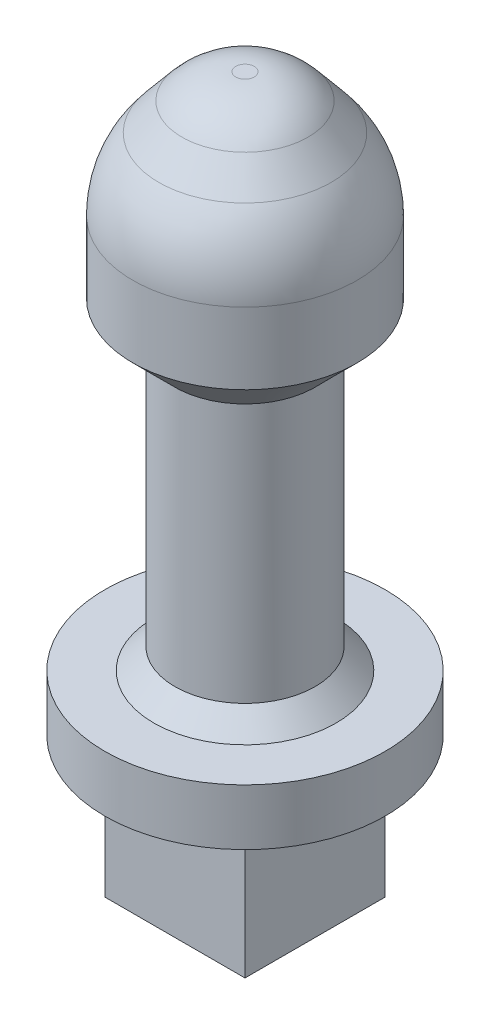
ISO-10303-21;
HEADER;
FILE_DESCRIPTION(('STEP AP214'),'2;1');
FILE_NAME('part.step','',(''),(''),'','','');
FILE_SCHEMA(('AUTOMOTIVE_DESIGN { 1 0 10303 214 1 1 1 1 }'));
ENDSEC;
DATA;
#1=APPLICATION_CONTEXT('core data for automotive mechanical design processes');
#2=APPLICATION_PROTOCOL_DEFINITION('international standard','automotive_design',2000,#1);
#3=PRODUCT_CONTEXT('',#1,'mechanical');
#4=PRODUCT('Part','Part','',(#3));
#5=PRODUCT_RELATED_PRODUCT_CATEGORY('part','',(#4));
#6=PRODUCT_DEFINITION_FORMATION('','',#4);
#7=PRODUCT_DEFINITION_CONTEXT('part definition',#1,'design');
#8=PRODUCT_DEFINITION('design','',#6,#7);
#9=PRODUCT_DEFINITION_SHAPE('','',#8);
#10=(LENGTH_UNIT() NAMED_UNIT(*) SI_UNIT(.MILLI.,.METRE.));
#11=(NAMED_UNIT(*) PLANE_ANGLE_UNIT() SI_UNIT($,.RADIAN.));
#12=(NAMED_UNIT(*) SI_UNIT($,.STERADIAN.) SOLID_ANGLE_UNIT());
#13=UNCERTAINTY_MEASURE_WITH_UNIT(LENGTH_MEASURE(1.E-05),#10,'distance_accuracy_value','');
#14=(GEOMETRIC_REPRESENTATION_CONTEXT(3) GLOBAL_UNCERTAINTY_ASSIGNED_CONTEXT((#13)) GLOBAL_UNIT_ASSIGNED_CONTEXT((#10,
#11,#12)) REPRESENTATION_CONTEXT('',''));
#15=CARTESIAN_POINT('',(0.,0.,0.));
#16=DIRECTION('',(0.,0.,1.));
#17=DIRECTION('',(1.,0.,0.));
#18=AXIS2_PLACEMENT_3D('',#15,#16,#17);
#19=CARTESIAN_POINT('',(-5.,10.,-5.));
#20=DIRECTION('',(0.,0.,1.));
#21=DIRECTION('',(1.,0.,0.));
#22=AXIS2_PLACEMENT_3D('',#19,#20,#21);
#23=PLANE('',#22);
#24=DIRECTION('',(0.,-1.,0.));
#25=VECTOR('',#24,1.);
#26=CARTESIAN_POINT('',(-1.6,51.001,-5.));
#27=LINE('',#26,#25);
#28=CARTESIAN_POINT('',(-1.6,6.,-5.));
#29=VERTEX_POINT('',#28);
#30=CARTESIAN_POINT('',(-1.6,0.,-5.));
#31=VERTEX_POINT('',#30);
#32=EDGE_CURVE('E50',#29,#31,#27,.T.);
#33=ORIENTED_EDGE('',*,*,#32,.T.);
#34=DIRECTION('',(-1.,0.,0.));
#35=VECTOR('',#34,1.);
#36=CARTESIAN_POINT('',(-5.,0.,-5.));
#37=LINE('',#36,#35);
#38=CARTESIAN_POINT('',(-5.,0.,-5.));
#39=VERTEX_POINT('',#38);
#40=EDGE_CURVE('E135',#31,#39,#37,.T.);
#41=ORIENTED_EDGE('',*,*,#40,.T.);
#42=DIRECTION('',(0.,-1.,0.));
#43=VECTOR('',#42,1.);
#44=CARTESIAN_POINT('',(-5.,10.,-5.));
#45=LINE('',#44,#43);
#46=CARTESIAN_POINT('',(-5.,10.,-5.));
#47=VERTEX_POINT('',#46);
#48=EDGE_CURVE('E165',#47,#39,#45,.T.);
#49=ORIENTED_EDGE('',*,*,#48,.F.);
#50=DIRECTION('',(-1.,0.,0.));
#51=VECTOR('',#50,1.);
#52=CARTESIAN_POINT('',(-5.,10.,-5.));
#53=LINE('',#52,#51);
#54=CARTESIAN_POINT('',(5.,10.,-5.));
#55=VERTEX_POINT('',#54);
#56=EDGE_CURVE('E249',#55,#47,#53,.T.);
#57=ORIENTED_EDGE('',*,*,#56,.F.);
#58=DIRECTION('',(0.,-1.,0.));
#59=VECTOR('',#58,1.);
#60=CARTESIAN_POINT('',(5.,10.,-5.));
#61=LINE('',#60,#59);
#62=CARTESIAN_POINT('',(5.,0.,-5.));
#63=VERTEX_POINT('',#62);
#64=EDGE_CURVE('E167',#55,#63,#61,.T.);
#65=ORIENTED_EDGE('',*,*,#64,.T.);
#66=CARTESIAN_POINT('',(1.6,0.,-5.));
#67=VERTEX_POINT('',#66);
#68=EDGE_CURVE('E145',#63,#67,#37,.T.);
#69=ORIENTED_EDGE('',*,*,#68,.T.);
#70=DIRECTION('',(0.,-1.,0.));
#71=VECTOR('',#70,1.);
#72=CARTESIAN_POINT('',(1.6,51.001,-5.));
#73=LINE('',#72,#71);
#74=CARTESIAN_POINT('',(1.6,6.,-5.));
#75=VERTEX_POINT('',#74);
#76=EDGE_CURVE('E139',#75,#67,#73,.T.);
#77=ORIENTED_EDGE('',*,*,#76,.F.);
#78=DIRECTION('',(-1.,0.,0.));
#79=VECTOR('',#78,1.);
#80=CARTESIAN_POINT('',(3.,6.,-5.));
#81=LINE('',#80,#79);
#82=CARTESIAN_POINT('',(3.,6.,-5.));
#83=VERTEX_POINT('',#82);
#84=EDGE_CURVE('E334',#83,#75,#81,.T.);
#85=ORIENTED_EDGE('',*,*,#84,.F.);
#86=DIRECTION('',(0.,-1.,0.));
#87=VECTOR('',#86,1.);
#88=CARTESIAN_POINT('',(3.,9.,-5.));
#89=LINE('',#88,#87);
#90=CARTESIAN_POINT('',(3.,9.,-5.));
#91=VERTEX_POINT('',#90);
#92=EDGE_CURVE('E349',#91,#83,#89,.T.);
#93=ORIENTED_EDGE('',*,*,#92,.F.);
#94=DIRECTION('',(1.,0.,0.));
#95=VECTOR('',#94,1.);
#96=CARTESIAN_POINT('',(3.,9.,-5.));
#97=LINE('',#96,#95);
#98=CARTESIAN_POINT('',(-3.,9.,-5.));
#99=VERTEX_POINT('',#98);
#100=EDGE_CURVE('E346',#99,#91,#97,.T.);
#101=ORIENTED_EDGE('',*,*,#100,.F.);
#102=DIRECTION('',(0.,1.,0.));
#103=VECTOR('',#102,1.);
#104=CARTESIAN_POINT('',(-3.,9.,-5.));
#105=LINE('',#104,#103);
#106=CARTESIAN_POINT('',(-3.,6.,-5.));
#107=VERTEX_POINT('',#106);
#108=EDGE_CURVE('E344',#107,#99,#105,.T.);
#109=ORIENTED_EDGE('',*,*,#108,.F.);
#110=EDGE_CURVE('E138',#29,#107,#81,.T.);
#111=ORIENTED_EDGE('',*,*,#110,.F.);
#112=EDGE_LOOP('',(#33,#41,#49,#57,#65,#69,#77,#85,#93,#101,#109,#111));
#113=FACE_BOUND('',#112,.T.);
#114=ADVANCED_FACE('F34',(#113),#23,.F.);
#115=CARTESIAN_POINT('',(0.,0.,0.));
#116=DIRECTION('',(0.,-1.,0.));
#117=DIRECTION('',(0.,0.,-1.));
#118=AXIS2_PLACEMENT_3D('',#115,#116,#117);
#119=PLANE('',#118);
#120=ORIENTED_EDGE('',*,*,#40,.F.);
#121=DIRECTION('',(0.,0.,1.));
#122=VECTOR('',#121,1.);
#123=CARTESIAN_POINT('',(-1.6,0.,0.));
#124=LINE('',#123,#122);
#125=CARTESIAN_POINT('',(-1.6,0.,0.));
#126=VERTEX_POINT('',#125);
#127=EDGE_CURVE('E122',#31,#126,#124,.T.);
#128=ORIENTED_EDGE('',*,*,#127,.T.);
#129=CARTESIAN_POINT('',(0.,0.,0.));
#130=DIRECTION('',(0.,-1.,0.));
#131=DIRECTION('',(0.,0.,-1.));
#132=AXIS2_PLACEMENT_3D('',#129,#130,#131);
#133=CIRCLE('',#132,1.6);
#134=CARTESIAN_POINT('',(1.6,0.,0.));
#135=VERTEX_POINT('',#134);
#136=EDGE_CURVE('E225',#135,#126,#133,.T.);
#137=ORIENTED_EDGE('',*,*,#136,.F.);
#138=DIRECTION('',(0.,0.,-1.));
#139=VECTOR('',#138,1.);
#140=CARTESIAN_POINT('',(1.6,0.,0.));
#141=LINE('',#140,#139);
#142=EDGE_CURVE('E130',#135,#67,#141,.T.);
#143=ORIENTED_EDGE('',*,*,#142,.T.);
#144=ORIENTED_EDGE('',*,*,#68,.F.);
#145=DIRECTION('',(0.,0.,-1.));
#146=VECTOR('',#145,1.);
#147=CARTESIAN_POINT('',(5.,0.,5.));
#148=LINE('',#147,#146);
#149=CARTESIAN_POINT('',(5.,0.,5.));
#150=VERTEX_POINT('',#149);
#151=EDGE_CURVE('E146',#150,#63,#148,.T.);
#152=ORIENTED_EDGE('',*,*,#151,.F.);
#153=DIRECTION('',(1.,0.,0.));
#154=VECTOR('',#153,1.);
#155=CARTESIAN_POINT('',(-5.,0.,5.));
#156=LINE('',#155,#154);
#157=CARTESIAN_POINT('',(-5.,0.,5.));
#158=VERTEX_POINT('',#157);
#159=EDGE_CURVE('E155',#158,#150,#156,.T.);
#160=ORIENTED_EDGE('',*,*,#159,.F.);
#161=DIRECTION('',(0.,0.,1.));
#162=VECTOR('',#161,1.);
#163=CARTESIAN_POINT('',(-5.,0.,5.));
#164=LINE('',#163,#162);
#165=EDGE_CURVE('E144',#39,#158,#164,.T.);
#166=ORIENTED_EDGE('',*,*,#165,.F.);
#167=EDGE_LOOP('',(#120,#128,#137,#143,#144,#152,#160,#166));
#168=FACE_BOUND('',#167,.T.);
#169=ADVANCED_FACE('F142',(#168),#119,.T.);
#170=CARTESIAN_POINT('',(3.,6.,3.));
#171=DIRECTION('',(0.,-1.,0.));
#172=DIRECTION('',(0.,0.,-1.));
#173=AXIS2_PLACEMENT_3D('',#170,#171,#172);
#174=PLANE('',#173);
#175=DIRECTION('',(0.,0.,-1.));
#176=VECTOR('',#175,1.);
#177=CARTESIAN_POINT('',(-1.6,6.,0.));
#178=LINE('',#177,#176);
#179=CARTESIAN_POINT('',(-1.6,6.,0.));
#180=VERTEX_POINT('',#179);
#181=EDGE_CURVE('E131',#180,#29,#178,.T.);
#182=ORIENTED_EDGE('',*,*,#181,.T.);
#183=ORIENTED_EDGE('',*,*,#110,.T.);
#184=DIRECTION('',(0.,0.,-1.));
#185=VECTOR('',#184,1.);
#186=CARTESIAN_POINT('',(-3.,6.,3.));
#187=LINE('',#186,#185);
#188=CARTESIAN_POINT('',(-3.,6.,3.));
#189=VERTEX_POINT('',#188);
#190=EDGE_CURVE('E353',#189,#107,#187,.T.);
#191=ORIENTED_EDGE('',*,*,#190,.F.);
#192=DIRECTION('',(-1.,0.,0.));
#193=VECTOR('',#192,1.);
#194=CARTESIAN_POINT('',(3.,6.,3.));
#195=LINE('',#194,#193);
#196=CARTESIAN_POINT('',(3.,6.,3.));
#197=VERTEX_POINT('',#196);
#198=EDGE_CURVE('E340',#197,#189,#195,.T.);
#199=ORIENTED_EDGE('',*,*,#198,.F.);
#200=DIRECTION('',(0.,0.,-1.));
#201=VECTOR('',#200,1.);
#202=CARTESIAN_POINT('',(3.,6.,3.));
#203=LINE('',#202,#201);
#204=EDGE_CURVE('E356',#197,#83,#203,.T.);
#205=ORIENTED_EDGE('',*,*,#204,.T.);
#206=ORIENTED_EDGE('',*,*,#84,.T.);
#207=DIRECTION('',(0.,0.,1.));
#208=VECTOR('',#207,1.);
#209=CARTESIAN_POINT('',(1.6,6.,0.));
#210=LINE('',#209,#208);
#211=CARTESIAN_POINT('',(1.6,6.,0.));
#212=VERTEX_POINT('',#211);
#213=EDGE_CURVE('E323',#75,#212,#210,.T.);
#214=ORIENTED_EDGE('',*,*,#213,.T.);
#215=CARTESIAN_POINT('',(0.,6.,0.));
#216=DIRECTION('',(0.,-1.,0.));
#217=DIRECTION('',(0.,0.,-1.));
#218=AXIS2_PLACEMENT_3D('',#215,#216,#217);
#219=CIRCLE('',#218,1.6);
#220=EDGE_CURVE('E230',#212,#180,#219,.T.);
#221=ORIENTED_EDGE('',*,*,#220,.T.);
#222=EDGE_LOOP('',(#182,#183,#191,#199,#205,#206,#214,#221));
#223=FACE_BOUND('',#222,.T.);
#224=ADVANCED_FACE('F191',(#223),#174,.F.);
#225=CARTESIAN_POINT('',(5.,10.,5.));
#226=DIRECTION('',(-1.,0.,0.));
#227=DIRECTION('',(0.,0.,1.));
#228=AXIS2_PLACEMENT_3D('',#225,#226,#227);
#229=PLANE('',#228);
#230=ORIENTED_EDGE('',*,*,#151,.T.);
#231=ORIENTED_EDGE('',*,*,#64,.F.);
#232=DIRECTION('',(0.,0.,-1.));
#233=VECTOR('',#232,1.);
#234=CARTESIAN_POINT('',(5.,10.,5.));
#235=LINE('',#234,#233);
#236=CARTESIAN_POINT('',(5.,10.,5.));
#237=VERTEX_POINT('',#236);
#238=EDGE_CURVE('E157',#237,#55,#235,.T.);
#239=ORIENTED_EDGE('',*,*,#238,.F.);
#240=DIRECTION('',(0.,-1.,0.));
#241=VECTOR('',#240,1.);
#242=CARTESIAN_POINT('',(5.,10.,5.));
#243=LINE('',#242,#241);
#244=EDGE_CURVE('E158',#237,#150,#243,.T.);
#245=ORIENTED_EDGE('',*,*,#244,.T.);
#246=EDGE_LOOP('',(#230,#231,#239,#245));
#247=FACE_BOUND('',#246,.T.);
#248=ADVANCED_FACE('F197',(#247),#229,.F.);
#249=CARTESIAN_POINT('',(-5.,10.,5.));
#250=DIRECTION('',(1.,0.,0.));
#251=DIRECTION('',(0.,0.,-1.));
#252=AXIS2_PLACEMENT_3D('',#249,#250,#251);
#253=PLANE('',#252);
#254=ORIENTED_EDGE('',*,*,#165,.T.);
#255=DIRECTION('',(0.,-1.,0.));
#256=VECTOR('',#255,1.);
#257=CARTESIAN_POINT('',(-5.,10.,5.));
#258=LINE('',#257,#256);
#259=CARTESIAN_POINT('',(-5.,10.,5.));
#260=VERTEX_POINT('',#259);
#261=EDGE_CURVE('E161',#260,#158,#258,.T.);
#262=ORIENTED_EDGE('',*,*,#261,.F.);
#263=DIRECTION('',(0.,0.,1.));
#264=VECTOR('',#263,1.);
#265=CARTESIAN_POINT('',(-5.,10.,5.));
#266=LINE('',#265,#264);
#267=EDGE_CURVE('E252',#47,#260,#266,.T.);
#268=ORIENTED_EDGE('',*,*,#267,.F.);
#269=ORIENTED_EDGE('',*,*,#48,.T.);
#270=EDGE_LOOP('',(#254,#262,#268,#269));
#271=FACE_BOUND('',#270,.T.);
#272=ADVANCED_FACE('F195',(#271),#253,.F.);
#273=CARTESIAN_POINT('',(-5.,10.,5.));
#274=DIRECTION('',(0.,0.,-1.));
#275=DIRECTION('',(-1.,0.,0.));
#276=AXIS2_PLACEMENT_3D('',#273,#274,#275);
#277=PLANE('',#276);
#278=ORIENTED_EDGE('',*,*,#159,.T.);
#279=ORIENTED_EDGE('',*,*,#244,.F.);
#280=DIRECTION('',(1.,0.,0.));
#281=VECTOR('',#280,1.);
#282=CARTESIAN_POINT('',(-5.,10.,5.));
#283=LINE('',#282,#281);
#284=EDGE_CURVE('E162',#260,#237,#283,.T.);
#285=ORIENTED_EDGE('',*,*,#284,.F.);
#286=ORIENTED_EDGE('',*,*,#261,.T.);
#287=EDGE_LOOP('',(#278,#279,#285,#286));
#288=FACE_BOUND('',#287,.T.);
#289=ADVANCED_FACE('F261',(#288),#277,.F.);
#290=CARTESIAN_POINT('',(0.,10.,0.));
#291=DIRECTION('',(0.,1.,0.));
#292=DIRECTION('',(0.,0.,1.));
#293=AXIS2_PLACEMENT_3D('',#290,#291,#292);
#294=PLANE('',#293);
#295=CARTESIAN_POINT('',(0.,10.,0.));
#296=DIRECTION('',(0.,1.,0.));
#297=DIRECTION('',(0.,0.,1.));
#298=AXIS2_PLACEMENT_3D('',#295,#296,#297);
#299=CIRCLE('',#298,10.);
#300=CARTESIAN_POINT('',(0.,10.,10.));
#301=VERTEX_POINT('',#300);
#302=EDGE_CURVE('E242',#301,#301,#299,.T.);
#303=ORIENTED_EDGE('',*,*,#302,.F.);
#304=EDGE_LOOP('',(#303));
#305=FACE_BOUND('',#304,.T.);
#306=ORIENTED_EDGE('',*,*,#284,.T.);
#307=ORIENTED_EDGE('',*,*,#238,.T.);
#308=ORIENTED_EDGE('',*,*,#56,.T.);
#309=ORIENTED_EDGE('',*,*,#267,.T.);
#310=EDGE_LOOP('',(#306,#307,#308,#309));
#311=FACE_BOUND('',#310,.T.);
#312=ADVANCED_FACE('F257',(#305,#311),#294,.F.);
#313=CARTESIAN_POINT('',(0.,14.,0.));
#314=DIRECTION('',(0.,-1.,0.));
#315=DIRECTION('',(0.,0.,-1.));
#316=AXIS2_PLACEMENT_3D('',#313,#314,#315);
#317=CYLINDRICAL_SURFACE('',#316,10.);
#318=CARTESIAN_POINT('',(0.,14.,0.));
#319=DIRECTION('',(0.,1.,0.));
#320=DIRECTION('',(0.,0.,1.));
#321=AXIS2_PLACEMENT_3D('',#318,#319,#320);
#322=CIRCLE('',#321,10.);
#323=CARTESIAN_POINT('',(0.,14.,10.));
#324=VERTEX_POINT('',#323);
#325=EDGE_CURVE('E150',#324,#324,#322,.T.);
#326=ORIENTED_EDGE('',*,*,#325,.F.);
#327=EDGE_LOOP('',(#326));
#328=FACE_BOUND('',#327,.T.);
#329=ORIENTED_EDGE('',*,*,#302,.T.);
#330=EDGE_LOOP('',(#329));
#331=FACE_BOUND('',#330,.T.);
#332=ADVANCED_FACE('F274',(#328,#331),#317,.T.);
#333=CARTESIAN_POINT('',(0.,14.,0.));
#334=DIRECTION('',(0.,1.,0.));
#335=DIRECTION('',(0.,0.,1.));
#336=AXIS2_PLACEMENT_3D('',#333,#334,#335);
#337=PLANE('',#336);
#338=CARTESIAN_POINT('',(0.,14.,0.));
#339=DIRECTION('',(0.,1.,0.));
#340=DIRECTION('',(0.,0.,1.));
#341=AXIS2_PLACEMENT_3D('',#338,#339,#340);
#342=CIRCLE('',#341,6.5);
#343=CARTESIAN_POINT('',(0.,14.,6.5));
#344=VERTEX_POINT('',#343);
#345=EDGE_CURVE('E11',#344,#344,#342,.F.);
#346=ORIENTED_EDGE('',*,*,#345,.T.);
#347=EDGE_LOOP('',(#346));
#348=FACE_BOUND('',#347,.T.);
#349=ORIENTED_EDGE('',*,*,#325,.T.);
#350=EDGE_LOOP('',(#349));
#351=FACE_BOUND('',#350,.T.);
#352=ADVANCED_FACE('F279',(#348,#351),#337,.T.);
#353=CARTESIAN_POINT('',(0.,37.,0.));
#354=DIRECTION('',(0.,-1.,0.));
#355=DIRECTION('',(0.,0.,-1.));
#356=AXIS2_PLACEMENT_3D('',#353,#354,#355);
#357=CYLINDRICAL_SURFACE('',#356,5.);
#358=CARTESIAN_POINT('',(0.,15.5,0.));
#359=DIRECTION('',(0.,1.,0.));
#360=DIRECTION('',(0.,0.,1.));
#361=AXIS2_PLACEMENT_3D('',#358,#359,#360);
#362=CIRCLE('',#361,5.);
#363=CARTESIAN_POINT('',(0.,15.5,5.));
#364=VERTEX_POINT('',#363);
#365=EDGE_CURVE('E43',#364,#364,#362,.T.);
#366=ORIENTED_EDGE('',*,*,#365,.T.);
#367=EDGE_LOOP('',(#366));
#368=FACE_BOUND('',#367,.T.);
#369=CARTESIAN_POINT('',(0.,34.,0.));
#370=DIRECTION('',(0.,-1.,0.));
#371=DIRECTION('',(0.,0.,-1.));
#372=AXIS2_PLACEMENT_3D('',#369,#370,#371);
#373=CIRCLE('',#372,5.);
#374=CARTESIAN_POINT('',(0.,34.,-5.));
#375=VERTEX_POINT('',#374);
#376=EDGE_CURVE('E170',#375,#375,#373,.T.);
#377=ORIENTED_EDGE('',*,*,#376,.T.);
#378=EDGE_LOOP('',(#377));
#379=FACE_BOUND('',#378,.T.);
#380=ADVANCED_FACE('F175',(#368,#379),#357,.T.);
#381=CARTESIAN_POINT('',(0.,51.,0.));
#382=DIRECTION('',(0.,1.,0.));
#383=DIRECTION('',(0.,0.,1.));
#384=AXIS2_PLACEMENT_3D('',#381,#382,#383);
#385=PLANE('',#384);
#386=CARTESIAN_POINT('',(0.,51.,0.));
#387=DIRECTION('',(0.,-1.,0.));
#388=DIRECTION('',(0.,0.,-1.));
#389=AXIS2_PLACEMENT_3D('',#386,#387,#388);
#390=CIRCLE('',#389,0.658125270077784);
#391=CARTESIAN_POINT('',(0.,51.,-0.658125270077784));
#392=VERTEX_POINT('',#391);
#393=EDGE_CURVE('E239',#392,#392,#390,.T.);
#394=ORIENTED_EDGE('',*,*,#393,.F.);
#395=EDGE_LOOP('',(#394));
#396=FACE_BOUND('',#395,.T.);
#397=ADVANCED_FACE('F287',(#396),#385,.T.);
#398=CARTESIAN_POINT('',(0.,46.,0.));
#399=DIRECTION('',(0.,-1.,0.));
#400=DIRECTION('',(0.,0.,-1.));
#401=AXIS2_PLACEMENT_3D('',#398,#399,#400);
#402=DEGENERATE_TOROIDAL_SURFACE('',#401,0.658125270077784,4.99999999999999,.T.);
#403=ORIENTED_EDGE('',*,*,#393,.T.);
#404=EDGE_LOOP('',(#403));
#405=FACE_BOUND('',#404,.T.);
#406=CARTESIAN_POINT('',(0.,49.2009219983224,0.));
#407=DIRECTION('',(0.,-1.,0.));
#408=DIRECTION('',(0.,0.,-1.));
#409=AXIS2_PLACEMENT_3D('',#406,#407,#408);
#410=CIRCLE('',#409,4.49923166806466);
#411=CARTESIAN_POINT('',(0.,49.2009219983224,-4.49923166806466));
#412=VERTEX_POINT('',#411);
#413=EDGE_CURVE('E236',#412,#412,#410,.T.);
#414=ORIENTED_EDGE('',*,*,#413,.F.);
#415=EDGE_LOOP('',(#414));
#416=FACE_BOUND('',#415,.T.);
#417=ADVANCED_FACE('F290',(#405,#416),#402,.T.);
#418=CARTESIAN_POINT('',(0.,47.2250757158652,0.));
#419=DIRECTION('',(0.,-1.,0.));
#420=DIRECTION('',(0.,0.,-1.));
#421=AXIS2_PLACEMENT_3D('',#418,#419,#420);
#422=CONICAL_SURFACE('',#421,6.14577023677901,0.694738276196705);
#423=ORIENTED_EDGE('',*,*,#413,.T.);
#424=EDGE_LOOP('',(#423));
#425=FACE_BOUND('',#424,.T.);
#426=CARTESIAN_POINT('',(0.,47.2250757158652,0.));
#427=DIRECTION('',(0.,-1.,0.));
#428=DIRECTION('',(0.,0.,-1.));
#429=AXIS2_PLACEMENT_3D('',#426,#427,#428);
#430=CIRCLE('',#429,6.14577023677901);
#431=CARTESIAN_POINT('',(0.,47.2250757158652,-6.14577023677901));
#432=VERTEX_POINT('',#431);
#433=EDGE_CURVE('E228',#432,#432,#430,.T.);
#434=ORIENTED_EDGE('',*,*,#433,.F.);
#435=EDGE_LOOP('',(#434));
#436=FACE_BOUND('',#435,.T.);
#437=ADVANCED_FACE('F294',(#425,#436),#422,.T.);
#438=CARTESIAN_POINT('',(0.,42.1036005185493,0.));
#439=DIRECTION('',(0.,-1.,0.));
#440=DIRECTION('',(1.,0.,0.));
#441=AXIS2_PLACEMENT_3D('',#438,#439,#440);
#442=SPHERICAL_SURFACE('',#441,8.);
#443=ORIENTED_EDGE('',*,*,#433,.T.);
#444=EDGE_LOOP('',(#443));
#445=FACE_BOUND('',#444,.T.);
#446=CARTESIAN_POINT('',(0.,42.1036005185493,0.));
#447=DIRECTION('',(0.,-1.,0.));
#448=DIRECTION('',(0.,0.,-1.));
#449=AXIS2_PLACEMENT_3D('',#446,#447,#448);
#450=CIRCLE('',#449,8.);
#451=CARTESIAN_POINT('',(0.,42.1036005185493,-8.));
#452=VERTEX_POINT('',#451);
#453=EDGE_CURVE('E224',#452,#452,#450,.T.);
#454=ORIENTED_EDGE('',*,*,#453,.F.);
#455=EDGE_LOOP('',(#454));
#456=FACE_BOUND('',#455,.T.);
#457=ADVANCED_FACE('F215',(#445,#456),#442,.T.);
#458=CARTESIAN_POINT('',(0.,37.,0.));
#459=DIRECTION('',(0.,-1.,0.));
#460=DIRECTION('',(0.,0.,-1.));
#461=AXIS2_PLACEMENT_3D('',#458,#459,#460);
#462=CYLINDRICAL_SURFACE('',#461,8.);
#463=ORIENTED_EDGE('',*,*,#453,.T.);
#464=EDGE_LOOP('',(#463));
#465=FACE_BOUND('',#464,.T.);
#466=CARTESIAN_POINT('',(0.,37.,0.));
#467=DIRECTION('',(0.,-1.,0.));
#468=DIRECTION('',(0.,0.,-1.));
#469=AXIS2_PLACEMENT_3D('',#466,#467,#468);
#470=CIRCLE('',#469,8.);
#471=CARTESIAN_POINT('',(0.,37.,-8.));
#472=VERTEX_POINT('',#471);
#473=EDGE_CURVE('E222',#472,#472,#470,.T.);
#474=ORIENTED_EDGE('',*,*,#473,.F.);
#475=EDGE_LOOP('',(#474));
#476=FACE_BOUND('',#475,.T.);
#477=ADVANCED_FACE('F206',(#465,#476),#462,.T.);
#478=CARTESIAN_POINT('',(0.,37.,0.));
#479=DIRECTION('',(0.,1.,0.));
#480=DIRECTION('',(0.,0.,1.));
#481=AXIS2_PLACEMENT_3D('',#478,#479,#480);
#482=CONICAL_SURFACE('',#481,8.00000000000002,0.785398163397454);
#483=ORIENTED_EDGE('',*,*,#376,.F.);
#484=EDGE_LOOP('',(#483));
#485=FACE_BOUND('',#484,.T.);
#486=ORIENTED_EDGE('',*,*,#473,.T.);
#487=EDGE_LOOP('',(#486));
#488=FACE_BOUND('',#487,.T.);
#489=ADVANCED_FACE('F201',(#485,#488),#482,.T.);
#490=CARTESIAN_POINT('',(0.,6.,0.));
#491=DIRECTION('',(0.,-1.,0.));
#492=DIRECTION('',(0.,0.,-1.));
#493=AXIS2_PLACEMENT_3D('',#490,#491,#492);
#494=CYLINDRICAL_SURFACE('',#493,1.6);
#495=ORIENTED_EDGE('',*,*,#136,.T.);
#496=DIRECTION('',(0.,-1.,0.));
#497=VECTOR('',#496,1.);
#498=CARTESIAN_POINT('',(-1.6,51.001,0.));
#499=LINE('',#498,#497);
#500=EDGE_CURVE('E125',#180,#126,#499,.T.);
#501=ORIENTED_EDGE('',*,*,#500,.F.);
#502=ORIENTED_EDGE('',*,*,#220,.F.);
#503=DIRECTION('',(0.,-1.,0.));
#504=VECTOR('',#503,1.);
#505=CARTESIAN_POINT('',(1.6,51.001,0.));
#506=LINE('',#505,#504);
#507=EDGE_CURVE('E58',#212,#135,#506,.T.);
#508=ORIENTED_EDGE('',*,*,#507,.T.);
#509=EDGE_LOOP('',(#495,#501,#502,#508));
#510=FACE_BOUND('',#509,.T.);
#511=ADVANCED_FACE('F205',(#510),#494,.F.);
#512=CARTESIAN_POINT('',(-3.,9.,3.));
#513=DIRECTION('',(-1.,0.,0.));
#514=DIRECTION('',(0.,-1.,0.));
#515=AXIS2_PLACEMENT_3D('',#512,#513,#514);
#516=PLANE('',#515);
#517=ORIENTED_EDGE('',*,*,#108,.T.);
#518=DIRECTION('',(0.,0.,-1.));
#519=VECTOR('',#518,1.);
#520=CARTESIAN_POINT('',(-3.,9.,3.));
#521=LINE('',#520,#519);
#522=CARTESIAN_POINT('',(-3.,9.,3.));
#523=VERTEX_POINT('',#522);
#524=EDGE_CURVE('E343',#523,#99,#521,.T.);
#525=ORIENTED_EDGE('',*,*,#524,.F.);
#526=DIRECTION('',(0.,1.,0.));
#527=VECTOR('',#526,1.);
#528=CARTESIAN_POINT('',(-3.,9.,3.));
#529=LINE('',#528,#527);
#530=EDGE_CURVE('E330',#189,#523,#529,.T.);
#531=ORIENTED_EDGE('',*,*,#530,.F.);
#532=ORIENTED_EDGE('',*,*,#190,.T.);
#533=EDGE_LOOP('',(#517,#525,#531,#532));
#534=FACE_BOUND('',#533,.T.);
#535=ADVANCED_FACE('F212',(#534),#516,.F.);
#536=CARTESIAN_POINT('',(3.,9.,3.));
#537=DIRECTION('',(1.,0.,0.));
#538=DIRECTION('',(0.,0.,-1.));
#539=AXIS2_PLACEMENT_3D('',#536,#537,#538);
#540=PLANE('',#539);
#541=ORIENTED_EDGE('',*,*,#92,.T.);
#542=ORIENTED_EDGE('',*,*,#204,.F.);
#543=DIRECTION('',(0.,-1.,0.));
#544=VECTOR('',#543,1.);
#545=CARTESIAN_POINT('',(3.,9.,3.));
#546=LINE('',#545,#544);
#547=CARTESIAN_POINT('',(3.,9.,3.));
#548=VERTEX_POINT('',#547);
#549=EDGE_CURVE('E337',#548,#197,#546,.T.);
#550=ORIENTED_EDGE('',*,*,#549,.F.);
#551=DIRECTION('',(0.,0.,-1.));
#552=VECTOR('',#551,1.);
#553=CARTESIAN_POINT('',(3.,9.,3.));
#554=LINE('',#553,#552);
#555=EDGE_CURVE('E358',#548,#91,#554,.T.);
#556=ORIENTED_EDGE('',*,*,#555,.T.);
#557=EDGE_LOOP('',(#541,#542,#550,#556));
#558=FACE_BOUND('',#557,.T.);
#559=ADVANCED_FACE('F304',(#558),#540,.F.);
#560=CARTESIAN_POINT('',(3.,9.,3.));
#561=DIRECTION('',(0.,1.,0.));
#562=DIRECTION('',(-1.,0.,0.));
#563=AXIS2_PLACEMENT_3D('',#560,#561,#562);
#564=PLANE('',#563);
#565=ORIENTED_EDGE('',*,*,#100,.T.);
#566=ORIENTED_EDGE('',*,*,#555,.F.);
#567=DIRECTION('',(1.,0.,0.));
#568=VECTOR('',#567,1.);
#569=CARTESIAN_POINT('',(3.,9.,3.));
#570=LINE('',#569,#568);
#571=EDGE_CURVE('E333',#523,#548,#570,.T.);
#572=ORIENTED_EDGE('',*,*,#571,.F.);
#573=ORIENTED_EDGE('',*,*,#524,.T.);
#574=EDGE_LOOP('',(#565,#566,#572,#573));
#575=FACE_BOUND('',#574,.T.);
#576=ADVANCED_FACE('F306',(#575),#564,.F.);
#577=CARTESIAN_POINT('',(0.,0.,3.));
#578=DIRECTION('',(0.,0.,-1.));
#579=DIRECTION('',(-1.,0.,0.));
#580=AXIS2_PLACEMENT_3D('',#577,#578,#579);
#581=PLANE('',#580);
#582=ORIENTED_EDGE('',*,*,#530,.T.);
#583=ORIENTED_EDGE('',*,*,#571,.T.);
#584=ORIENTED_EDGE('',*,*,#549,.T.);
#585=ORIENTED_EDGE('',*,*,#198,.T.);
#586=EDGE_LOOP('',(#582,#583,#584,#585));
#587=FACE_BOUND('',#586,.T.);
#588=ADVANCED_FACE('F309',(#587),#581,.T.);
#589=CARTESIAN_POINT('',(1.6,51.001,0.));
#590=DIRECTION('',(-1.,0.,0.));
#591=DIRECTION('',(0.,0.,1.));
#592=AXIS2_PLACEMENT_3D('',#589,#590,#591);
#593=PLANE('',#592);
#594=ORIENTED_EDGE('',*,*,#76,.T.);
#595=ORIENTED_EDGE('',*,*,#142,.F.);
#596=ORIENTED_EDGE('',*,*,#507,.F.);
#597=ORIENTED_EDGE('',*,*,#213,.F.);
#598=EDGE_LOOP('',(#594,#595,#596,#597));
#599=FACE_BOUND('',#598,.T.);
#600=ADVANCED_FACE('F183',(#599),#593,.T.);
#601=CARTESIAN_POINT('',(-1.6,51.001,0.));
#602=DIRECTION('',(1.,0.,0.));
#603=DIRECTION('',(0.,0.,-1.));
#604=AXIS2_PLACEMENT_3D('',#601,#602,#603);
#605=PLANE('',#604);
#606=ORIENTED_EDGE('',*,*,#500,.T.);
#607=ORIENTED_EDGE('',*,*,#127,.F.);
#608=ORIENTED_EDGE('',*,*,#32,.F.);
#609=ORIENTED_EDGE('',*,*,#181,.F.);
#610=EDGE_LOOP('',(#606,#607,#608,#609));
#611=FACE_BOUND('',#610,.T.);
#612=ADVANCED_FACE('F123',(#611),#605,.T.);
#613=CARTESIAN_POINT('',(0.,15.5,0.));
#614=DIRECTION('',(0.,-1.,0.));
#615=DIRECTION('',(0.,0.,-1.));
#616=AXIS2_PLACEMENT_3D('',#613,#614,#615);
#617=CONICAL_SURFACE('',#616,5.,0.785398163397445);
#618=ORIENTED_EDGE('',*,*,#345,.F.);
#619=EDGE_LOOP('',(#618));
#620=FACE_BOUND('',#619,.T.);
#621=ORIENTED_EDGE('',*,*,#365,.F.);
#622=EDGE_LOOP('',(#621));
#623=FACE_BOUND('',#622,.T.);
#624=ADVANCED_FACE('F37',(#620,#623),#617,.T.);
#625=CLOSED_SHELL('',(#114,#169,#224,#248,#272,#289,#312,#332,#352,#380,#397,#417,#437,#457,
#477,#489,#511,#535,#559,#576,#588,#600,#612,#624));
#626=MANIFOLD_SOLID_BREP('B2',#625);
#627=ADVANCED_BREP_SHAPE_REPRESENTATION('',(#18,#626),#14);
#628=SHAPE_DEFINITION_REPRESENTATION(#9,#627);
ENDSEC;
END-ISO-10303-21;
